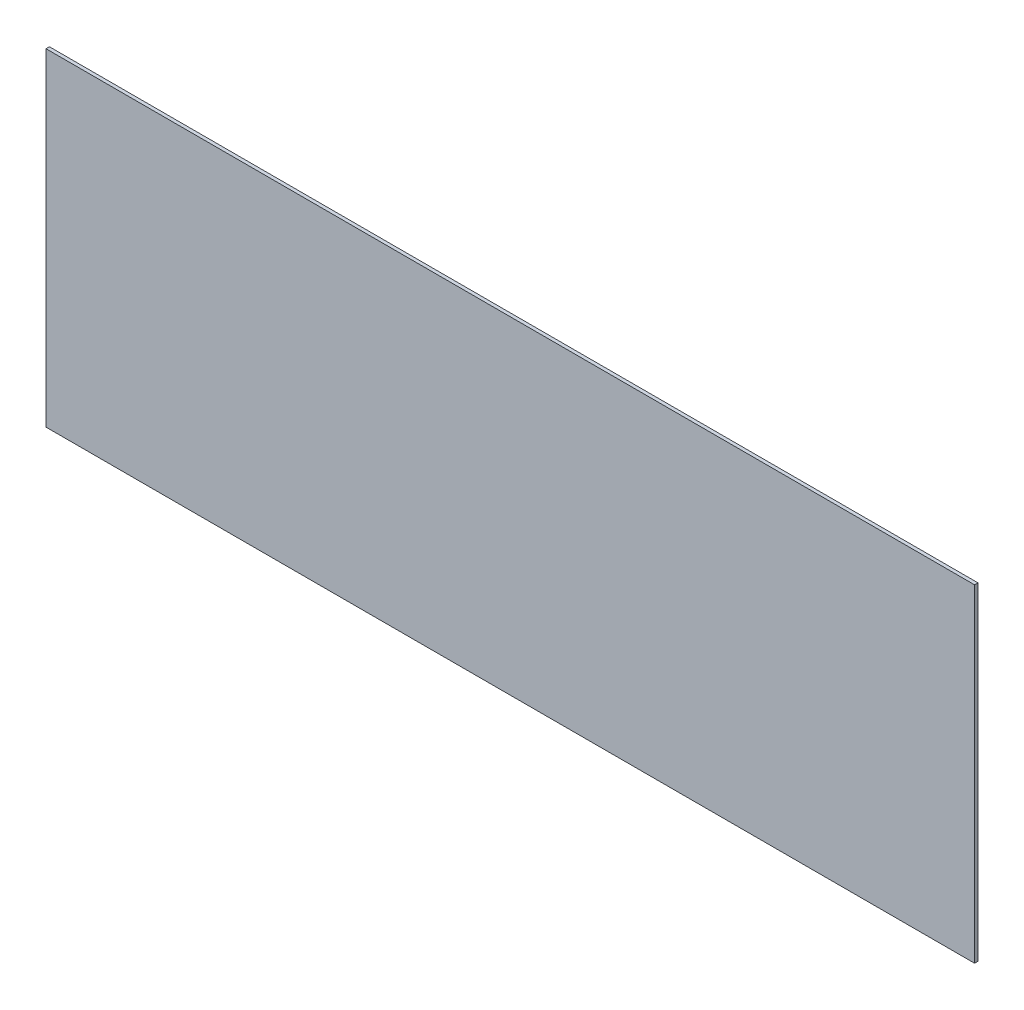
ISO-10303-21;
HEADER;
FILE_DESCRIPTION(('STEP AP214'),'2;1');
FILE_NAME('part.step','',(''),(''),'','','');
FILE_SCHEMA(('AUTOMOTIVE_DESIGN { 1 0 10303 214 1 1 1 1 }'));
ENDSEC;
DATA;
#1=APPLICATION_CONTEXT('core data for automotive mechanical design processes');
#2=APPLICATION_PROTOCOL_DEFINITION('international standard','automotive_design',2000,#1);
#3=PRODUCT_CONTEXT('',#1,'mechanical');
#4=PRODUCT('Part','Part','',(#3));
#5=PRODUCT_RELATED_PRODUCT_CATEGORY('part','',(#4));
#6=PRODUCT_DEFINITION_FORMATION('','',#4);
#7=PRODUCT_DEFINITION_CONTEXT('part definition',#1,'design');
#8=PRODUCT_DEFINITION('design','',#6,#7);
#9=PRODUCT_DEFINITION_SHAPE('','',#8);
#10=(LENGTH_UNIT() NAMED_UNIT(*) SI_UNIT(.MILLI.,.METRE.));
#11=(NAMED_UNIT(*) PLANE_ANGLE_UNIT() SI_UNIT($,.RADIAN.));
#12=(NAMED_UNIT(*) SI_UNIT($,.STERADIAN.) SOLID_ANGLE_UNIT());
#13=UNCERTAINTY_MEASURE_WITH_UNIT(LENGTH_MEASURE(1.E-05),#10,'distance_accuracy_value','');
#14=(GEOMETRIC_REPRESENTATION_CONTEXT(3) GLOBAL_UNCERTAINTY_ASSIGNED_CONTEXT((#13)) GLOBAL_UNIT_ASSIGNED_CONTEXT((#10,
#11,#12)) REPRESENTATION_CONTEXT('',''));
#15=CARTESIAN_POINT('',(0.,0.,0.));
#16=DIRECTION('',(0.,0.,1.));
#17=DIRECTION('',(1.,0.,0.));
#18=AXIS2_PLACEMENT_3D('',#15,#16,#17);
#19=CARTESIAN_POINT('',(-431.8,152.4,3.175));
#20=DIRECTION('',(1.,0.,0.));
#21=DIRECTION('',(0.,0.,-1.));
#22=AXIS2_PLACEMENT_3D('',#19,#20,#21);
#23=PLANE('',#22);
#24=DIRECTION('',(0.,-1.,0.));
#25=VECTOR('',#24,1.);
#26=CARTESIAN_POINT('',(-431.8,152.4,0.));
#27=LINE('',#26,#25);
#28=CARTESIAN_POINT('',(-431.8,152.4,0.));
#29=VERTEX_POINT('',#28);
#30=CARTESIAN_POINT('',(-431.8,-152.4,0.));
#31=VERTEX_POINT('',#30);
#32=EDGE_CURVE('E107',#29,#31,#27,.T.);
#33=ORIENTED_EDGE('',*,*,#32,.T.);
#34=DIRECTION('',(0.,0.,-1.));
#35=VECTOR('',#34,1.);
#36=CARTESIAN_POINT('',(-431.8,-152.4,3.175));
#37=LINE('',#36,#35);
#38=CARTESIAN_POINT('',(-431.8,-152.4,3.175));
#39=VERTEX_POINT('',#38);
#40=EDGE_CURVE('E11',#39,#31,#37,.T.);
#41=ORIENTED_EDGE('',*,*,#40,.F.);
#42=DIRECTION('',(0.,-1.,0.));
#43=VECTOR('',#42,1.);
#44=CARTESIAN_POINT('',(-431.8,152.4,3.175));
#45=LINE('',#44,#43);
#46=CARTESIAN_POINT('',(-431.8,152.4,3.175));
#47=VERTEX_POINT('',#46);
#48=EDGE_CURVE('E91',#47,#39,#45,.T.);
#49=ORIENTED_EDGE('',*,*,#48,.F.);
#50=DIRECTION('',(0.,0.,-1.));
#51=VECTOR('',#50,1.);
#52=CARTESIAN_POINT('',(-431.8,152.4,3.175));
#53=LINE('',#52,#51);
#54=EDGE_CURVE('E103',#47,#29,#53,.T.);
#55=ORIENTED_EDGE('',*,*,#54,.T.);
#56=EDGE_LOOP('',(#33,#41,#49,#55));
#57=FACE_BOUND('',#56,.T.);
#58=ADVANCED_FACE('F39',(#57),#23,.F.);
#59=CARTESIAN_POINT('',(-431.8,-152.4,3.175));
#60=DIRECTION('',(0.,1.,0.));
#61=DIRECTION('',(0.,0.,1.));
#62=AXIS2_PLACEMENT_3D('',#59,#60,#61);
#63=PLANE('',#62);
#64=DIRECTION('',(1.,0.,0.));
#65=VECTOR('',#64,1.);
#66=CARTESIAN_POINT('',(-431.8,-152.4,0.));
#67=LINE('',#66,#65);
#68=CARTESIAN_POINT('',(431.8,-152.4,0.));
#69=VERTEX_POINT('',#68);
#70=EDGE_CURVE('E96',#31,#69,#67,.T.);
#71=ORIENTED_EDGE('',*,*,#70,.T.);
#72=DIRECTION('',(0.,0.,-1.));
#73=VECTOR('',#72,1.);
#74=CARTESIAN_POINT('',(431.8,-152.4,3.175));
#75=LINE('',#74,#73);
#76=CARTESIAN_POINT('',(431.8,-152.4,3.175));
#77=VERTEX_POINT('',#76);
#78=EDGE_CURVE('E48',#77,#69,#75,.T.);
#79=ORIENTED_EDGE('',*,*,#78,.F.);
#80=DIRECTION('',(1.,0.,0.));
#81=VECTOR('',#80,1.);
#82=CARTESIAN_POINT('',(-431.8,-152.4,3.175));
#83=LINE('',#82,#81);
#84=EDGE_CURVE('E86',#39,#77,#83,.T.);
#85=ORIENTED_EDGE('',*,*,#84,.F.);
#86=ORIENTED_EDGE('',*,*,#40,.T.);
#87=EDGE_LOOP('',(#71,#79,#85,#86));
#88=FACE_BOUND('',#87,.T.);
#89=ADVANCED_FACE('F95',(#88),#63,.F.);
#90=CARTESIAN_POINT('',(431.8,152.4,3.175));
#91=DIRECTION('',(-1.,0.,0.));
#92=DIRECTION('',(0.,0.,1.));
#93=AXIS2_PLACEMENT_3D('',#90,#91,#92);
#94=PLANE('',#93);
#95=DIRECTION('',(0.,1.,0.));
#96=VECTOR('',#95,1.);
#97=CARTESIAN_POINT('',(431.8,152.4,0.));
#98=LINE('',#97,#96);
#99=CARTESIAN_POINT('',(431.8,152.4,0.));
#100=VERTEX_POINT('',#99);
#101=EDGE_CURVE('E73',#69,#100,#98,.T.);
#102=ORIENTED_EDGE('',*,*,#101,.T.);
#103=DIRECTION('',(0.,0.,-1.));
#104=VECTOR('',#103,1.);
#105=CARTESIAN_POINT('',(431.8,152.4,3.175));
#106=LINE('',#105,#104);
#107=CARTESIAN_POINT('',(431.8,152.4,3.175));
#108=VERTEX_POINT('',#107);
#109=EDGE_CURVE('E98',#108,#100,#106,.T.);
#110=ORIENTED_EDGE('',*,*,#109,.F.);
#111=DIRECTION('',(0.,1.,0.));
#112=VECTOR('',#111,1.);
#113=CARTESIAN_POINT('',(431.8,152.4,3.175));
#114=LINE('',#113,#112);
#115=EDGE_CURVE('E89',#77,#108,#114,.T.);
#116=ORIENTED_EDGE('',*,*,#115,.F.);
#117=ORIENTED_EDGE('',*,*,#78,.T.);
#118=EDGE_LOOP('',(#102,#110,#116,#117));
#119=FACE_BOUND('',#118,.T.);
#120=ADVANCED_FACE('F99',(#119),#94,.F.);
#121=CARTESIAN_POINT('',(-431.8,152.4,3.175));
#122=DIRECTION('',(0.,-1.,0.));
#123=DIRECTION('',(0.,0.,-1.));
#124=AXIS2_PLACEMENT_3D('',#121,#122,#123);
#125=PLANE('',#124);
#126=DIRECTION('',(-1.,0.,0.));
#127=VECTOR('',#126,1.);
#128=CARTESIAN_POINT('',(-431.8,152.4,0.));
#129=LINE('',#128,#127);
#130=EDGE_CURVE('E79',#100,#29,#129,.T.);
#131=ORIENTED_EDGE('',*,*,#130,.T.);
#132=ORIENTED_EDGE('',*,*,#54,.F.);
#133=DIRECTION('',(-1.,0.,0.));
#134=VECTOR('',#133,1.);
#135=CARTESIAN_POINT('',(-431.8,152.4,3.175));
#136=LINE('',#135,#134);
#137=EDGE_CURVE('E56',#108,#47,#136,.T.);
#138=ORIENTED_EDGE('',*,*,#137,.F.);
#139=ORIENTED_EDGE('',*,*,#109,.T.);
#140=EDGE_LOOP('',(#131,#132,#138,#139));
#141=FACE_BOUND('',#140,.T.);
#142=ADVANCED_FACE('F120',(#141),#125,.F.);
#143=CARTESIAN_POINT('',(0.,0.,3.175));
#144=DIRECTION('',(0.,0.,1.));
#145=DIRECTION('',(1.,0.,0.));
#146=AXIS2_PLACEMENT_3D('',#143,#144,#145);
#147=PLANE('',#146);
#148=ORIENTED_EDGE('',*,*,#48,.T.);
#149=ORIENTED_EDGE('',*,*,#84,.T.);
#150=ORIENTED_EDGE('',*,*,#115,.T.);
#151=ORIENTED_EDGE('',*,*,#137,.T.);
#152=EDGE_LOOP('',(#148,#149,#150,#151));
#153=FACE_BOUND('',#152,.T.);
#154=ADVANCED_FACE('F87',(#153),#147,.T.);
#155=CARTESIAN_POINT('',(0.,0.,0.));
#156=DIRECTION('',(0.,0.,1.));
#157=DIRECTION('',(1.,0.,0.));
#158=AXIS2_PLACEMENT_3D('',#155,#156,#157);
#159=PLANE('',#158);
#160=ORIENTED_EDGE('',*,*,#32,.F.);
#161=ORIENTED_EDGE('',*,*,#130,.F.);
#162=ORIENTED_EDGE('',*,*,#101,.F.);
#163=ORIENTED_EDGE('',*,*,#70,.F.);
#164=EDGE_LOOP('',(#160,#161,#162,#163));
#165=FACE_BOUND('',#164,.T.);
#166=ADVANCED_FACE('F123',(#165),#159,.F.);
#167=CLOSED_SHELL('',(#58,#89,#120,#142,#154,#166));
#168=MANIFOLD_SOLID_BREP('B2',#167);
#169=ADVANCED_BREP_SHAPE_REPRESENTATION('',(#18,#168),#14);
#170=SHAPE_DEFINITION_REPRESENTATION(#9,#169);
ENDSEC;
END-ISO-10303-21;
